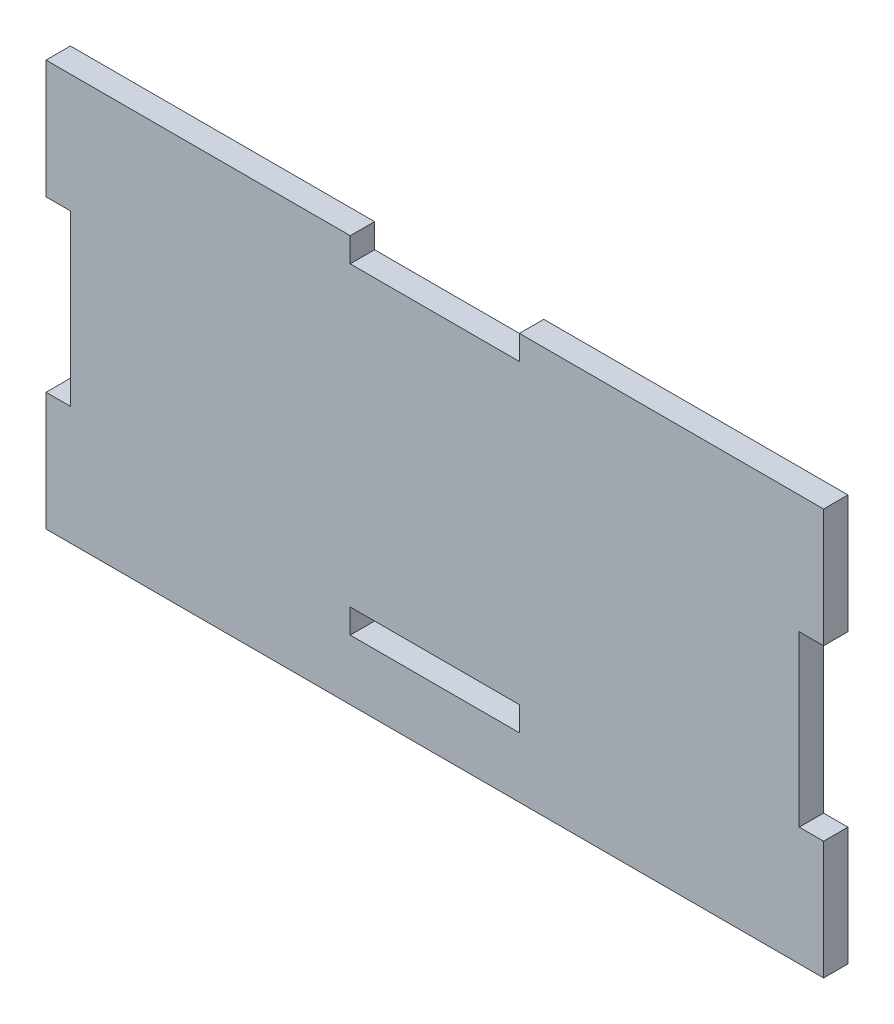
ISO-10303-21;
HEADER;
FILE_DESCRIPTION(('STEP AP214'),'2;1');
FILE_NAME('part.step','',(''),(''),'','','');
FILE_SCHEMA(('AUTOMOTIVE_DESIGN { 1 0 10303 214 1 1 1 1 }'));
ENDSEC;
DATA;
#1=APPLICATION_CONTEXT('core data for automotive mechanical design processes');
#2=APPLICATION_PROTOCOL_DEFINITION('international standard','automotive_design',2000,#1);
#3=PRODUCT_CONTEXT('',#1,'mechanical');
#4=PRODUCT('Part','Part','',(#3));
#5=PRODUCT_RELATED_PRODUCT_CATEGORY('part','',(#4));
#6=PRODUCT_DEFINITION_FORMATION('','',#4);
#7=PRODUCT_DEFINITION_CONTEXT('part definition',#1,'design');
#8=PRODUCT_DEFINITION('design','',#6,#7);
#9=PRODUCT_DEFINITION_SHAPE('','',#8);
#10=(LENGTH_UNIT() NAMED_UNIT(*) SI_UNIT(.MILLI.,.METRE.));
#11=(NAMED_UNIT(*) PLANE_ANGLE_UNIT() SI_UNIT($,.RADIAN.));
#12=(NAMED_UNIT(*) SI_UNIT($,.STERADIAN.) SOLID_ANGLE_UNIT());
#13=UNCERTAINTY_MEASURE_WITH_UNIT(LENGTH_MEASURE(1.E-05),#10,'distance_accuracy_value','');
#14=(GEOMETRIC_REPRESENTATION_CONTEXT(3) GLOBAL_UNCERTAINTY_ASSIGNED_CONTEXT((#13)) GLOBAL_UNIT_ASSIGNED_CONTEXT((#10,
#11,#12)) REPRESENTATION_CONTEXT('',''));
#15=CARTESIAN_POINT('',(0.,0.,0.));
#16=DIRECTION('',(0.,0.,1.));
#17=DIRECTION('',(1.,0.,0.));
#18=AXIS2_PLACEMENT_3D('',#15,#16,#17);
#19=CARTESIAN_POINT('',(-43.7642,-22.86,2.7432));
#20=DIRECTION('',(1.,0.,0.));
#21=DIRECTION('',(0.,0.,-1.));
#22=AXIS2_PLACEMENT_3D('',#19,#20,#21);
#23=PLANE('',#22);
#24=DIRECTION('',(0.,-1.,0.));
#25=VECTOR('',#24,1.);
#26=CARTESIAN_POINT('',(-43.7642,-22.86,0.));
#27=LINE('',#26,#25);
#28=CARTESIAN_POINT('',(-43.7642,22.86,0.));
#29=VERTEX_POINT('',#28);
#30=CARTESIAN_POINT('',(-43.7642,9.525,0.));
#31=VERTEX_POINT('',#30);
#32=EDGE_CURVE('E301',#29,#31,#27,.T.);
#33=ORIENTED_EDGE('',*,*,#32,.T.);
#34=DIRECTION('',(0.,0.,1.));
#35=VECTOR('',#34,1.);
#36=CARTESIAN_POINT('',(-43.7642,9.525,0.));
#37=LINE('',#36,#35);
#38=CARTESIAN_POINT('',(-43.7642,9.525,2.7432));
#39=VERTEX_POINT('',#38);
#40=EDGE_CURVE('E201',#31,#39,#37,.T.);
#41=ORIENTED_EDGE('',*,*,#40,.T.);
#42=DIRECTION('',(0.,-1.,0.));
#43=VECTOR('',#42,1.);
#44=CARTESIAN_POINT('',(-43.7642,-22.86,2.7432));
#45=LINE('',#44,#43);
#46=CARTESIAN_POINT('',(-43.7642,22.86,2.7432));
#47=VERTEX_POINT('',#46);
#48=EDGE_CURVE('E286',#47,#39,#45,.T.);
#49=ORIENTED_EDGE('',*,*,#48,.F.);
#50=DIRECTION('',(0.,0.,-1.));
#51=VECTOR('',#50,1.);
#52=CARTESIAN_POINT('',(-43.7642,22.86,2.7432));
#53=LINE('',#52,#51);
#54=EDGE_CURVE('E300',#47,#29,#53,.T.);
#55=ORIENTED_EDGE('',*,*,#54,.T.);
#56=EDGE_LOOP('',(#33,#41,#49,#55));
#57=FACE_BOUND('',#56,.T.);
#58=ADVANCED_FACE('F33',(#57),#23,.F.);
#59=CARTESIAN_POINT('',(43.7642,-22.86,2.7432));
#60=DIRECTION('',(-1.,0.,0.));
#61=DIRECTION('',(0.,0.,1.));
#62=AXIS2_PLACEMENT_3D('',#59,#60,#61);
#63=PLANE('',#62);
#64=DIRECTION('',(0.,1.,0.));
#65=VECTOR('',#64,1.);
#66=CARTESIAN_POINT('',(43.7642,-22.86,0.));
#67=LINE('',#66,#65);
#68=CARTESIAN_POINT('',(43.7642,-22.86,0.));
#69=VERTEX_POINT('',#68);
#70=CARTESIAN_POINT('',(43.7642,-9.52500000000001,0.));
#71=VERTEX_POINT('',#70);
#72=EDGE_CURVE('E307',#69,#71,#67,.T.);
#73=ORIENTED_EDGE('',*,*,#72,.T.);
#74=DIRECTION('',(0.,0.,1.));
#75=VECTOR('',#74,1.);
#76=CARTESIAN_POINT('',(43.7642,-9.52500000000001,0.));
#77=LINE('',#76,#75);
#78=CARTESIAN_POINT('',(43.7642,-9.52500000000001,2.7432));
#79=VERTEX_POINT('',#78);
#80=EDGE_CURVE('E199',#71,#79,#77,.T.);
#81=ORIENTED_EDGE('',*,*,#80,.T.);
#82=DIRECTION('',(0.,1.,0.));
#83=VECTOR('',#82,1.);
#84=CARTESIAN_POINT('',(43.7642,-22.86,2.7432));
#85=LINE('',#84,#83);
#86=CARTESIAN_POINT('',(43.7642,-22.86,2.7432));
#87=VERTEX_POINT('',#86);
#88=EDGE_CURVE('E293',#87,#79,#85,.T.);
#89=ORIENTED_EDGE('',*,*,#88,.F.);
#90=DIRECTION('',(0.,0.,-1.));
#91=VECTOR('',#90,1.);
#92=CARTESIAN_POINT('',(43.7642,-22.86,2.7432));
#93=LINE('',#92,#91);
#94=EDGE_CURVE('E41',#87,#69,#93,.T.);
#95=ORIENTED_EDGE('',*,*,#94,.T.);
#96=EDGE_LOOP('',(#73,#81,#89,#95));
#97=FACE_BOUND('',#96,.T.);
#98=ADVANCED_FACE('F323',(#97),#63,.F.);
#99=CARTESIAN_POINT('',(43.7642,22.86,2.7432));
#100=DIRECTION('',(0.,-1.,0.));
#101=DIRECTION('',(1.,0.,0.));
#102=AXIS2_PLACEMENT_3D('',#99,#100,#101);
#103=PLANE('',#102);
#104=DIRECTION('',(-1.,0.,0.));
#105=VECTOR('',#104,1.);
#106=CARTESIAN_POINT('',(43.7642,22.86,2.7432));
#107=LINE('',#106,#105);
#108=CARTESIAN_POINT('',(-9.525,22.86,2.7432));
#109=VERTEX_POINT('',#108);
#110=EDGE_CURVE('E296',#109,#47,#107,.T.);
#111=ORIENTED_EDGE('',*,*,#110,.F.);
#112=DIRECTION('',(0.,0.,1.));
#113=VECTOR('',#112,1.);
#114=CARTESIAN_POINT('',(-9.525,22.86,0.));
#115=LINE('',#114,#113);
#116=CARTESIAN_POINT('',(-9.525,22.86,0.));
#117=VERTEX_POINT('',#116);
#118=EDGE_CURVE('E220',#117,#109,#115,.T.);
#119=ORIENTED_EDGE('',*,*,#118,.F.);
#120=DIRECTION('',(-1.,0.,0.));
#121=VECTOR('',#120,1.);
#122=CARTESIAN_POINT('',(43.7642,22.86,0.));
#123=LINE('',#122,#121);
#124=EDGE_CURVE('E310',#117,#29,#123,.T.);
#125=ORIENTED_EDGE('',*,*,#124,.T.);
#126=ORIENTED_EDGE('',*,*,#54,.F.);
#127=EDGE_LOOP('',(#111,#119,#125,#126));
#128=FACE_BOUND('',#127,.T.);
#129=ADVANCED_FACE('F350',(#128),#103,.F.);
#130=CARTESIAN_POINT('',(0.,0.,2.7432));
#131=DIRECTION('',(0.,0.,1.));
#132=DIRECTION('',(1.,0.,0.));
#133=AXIS2_PLACEMENT_3D('',#130,#131,#132);
#134=PLANE('',#133);
#135=DIRECTION('',(-1.,0.,0.));
#136=VECTOR('',#135,1.);
#137=CARTESIAN_POINT('',(-41.021,9.525,2.7432));
#138=LINE('',#137,#136);
#139=CARTESIAN_POINT('',(-41.021,9.525,2.7432));
#140=VERTEX_POINT('',#139);
#141=EDGE_CURVE('E192',#140,#39,#138,.T.);
#142=ORIENTED_EDGE('',*,*,#141,.F.);
#143=DIRECTION('',(0.,1.,0.));
#144=VECTOR('',#143,1.);
#145=CARTESIAN_POINT('',(-41.021,-9.52500000000001,2.7432));
#146=LINE('',#145,#144);
#147=CARTESIAN_POINT('',(-41.021,-9.52500000000001,2.7432));
#148=VERTEX_POINT('',#147);
#149=EDGE_CURVE('E194',#148,#140,#146,.T.);
#150=ORIENTED_EDGE('',*,*,#149,.F.);
#151=DIRECTION('',(1.,0.,0.));
#152=VECTOR('',#151,1.);
#153=CARTESIAN_POINT('',(-41.021,-9.52500000000001,2.7432));
#154=LINE('',#153,#152);
#155=CARTESIAN_POINT('',(-43.7642,-9.52500000000001,2.7432));
#156=VERTEX_POINT('',#155);
#157=EDGE_CURVE('E172',#156,#148,#154,.T.);
#158=ORIENTED_EDGE('',*,*,#157,.F.);
#159=CARTESIAN_POINT('',(-43.7642,-22.86,2.7432));
#160=VERTEX_POINT('',#159);
#161=EDGE_CURVE('E290',#156,#160,#45,.T.);
#162=ORIENTED_EDGE('',*,*,#161,.T.);
#163=DIRECTION('',(1.,0.,0.));
#164=VECTOR('',#163,1.);
#165=CARTESIAN_POINT('',(43.7642,-22.86,2.7432));
#166=LINE('',#165,#164);
#167=EDGE_CURVE('E289',#160,#87,#166,.T.);
#168=ORIENTED_EDGE('',*,*,#167,.T.);
#169=ORIENTED_EDGE('',*,*,#88,.T.);
#170=DIRECTION('',(1.,0.,0.));
#171=VECTOR('',#170,1.);
#172=CARTESIAN_POINT('',(41.021,-9.52500000000001,2.7432));
#173=LINE('',#172,#171);
#174=CARTESIAN_POINT('',(41.021,-9.52500000000001,2.7432));
#175=VERTEX_POINT('',#174);
#176=EDGE_CURVE('E209',#175,#79,#173,.T.);
#177=ORIENTED_EDGE('',*,*,#176,.F.);
#178=DIRECTION('',(0.,-1.,0.));
#179=VECTOR('',#178,1.);
#180=CARTESIAN_POINT('',(41.021,9.525,2.7432));
#181=LINE('',#180,#179);
#182=CARTESIAN_POINT('',(41.021,9.525,2.7432));
#183=VERTEX_POINT('',#182);
#184=EDGE_CURVE('E219',#183,#175,#181,.T.);
#185=ORIENTED_EDGE('',*,*,#184,.F.);
#186=DIRECTION('',(-1.,0.,0.));
#187=VECTOR('',#186,1.);
#188=CARTESIAN_POINT('',(41.021,9.525,2.7432));
#189=LINE('',#188,#187);
#190=CARTESIAN_POINT('',(43.7642,9.525,2.7432));
#191=VERTEX_POINT('',#190);
#192=EDGE_CURVE('E216',#191,#183,#189,.T.);
#193=ORIENTED_EDGE('',*,*,#192,.F.);
#194=CARTESIAN_POINT('',(43.7642,22.86,2.7432));
#195=VERTEX_POINT('',#194);
#196=EDGE_CURVE('E292',#191,#195,#85,.T.);
#197=ORIENTED_EDGE('',*,*,#196,.T.);
#198=CARTESIAN_POINT('',(9.525,22.86,2.7432));
#199=VERTEX_POINT('',#198);
#200=EDGE_CURVE('E297',#195,#199,#107,.T.);
#201=ORIENTED_EDGE('',*,*,#200,.T.);
#202=DIRECTION('',(0.,1.,0.));
#203=VECTOR('',#202,1.);
#204=CARTESIAN_POINT('',(9.525,20.1168,2.7432));
#205=LINE('',#204,#203);
#206=CARTESIAN_POINT('',(9.525,20.1168,2.7432));
#207=VERTEX_POINT('',#206);
#208=EDGE_CURVE('E235',#207,#199,#205,.T.);
#209=ORIENTED_EDGE('',*,*,#208,.F.);
#210=DIRECTION('',(1.,0.,0.));
#211=VECTOR('',#210,1.);
#212=CARTESIAN_POINT('',(9.525,20.1168,2.7432));
#213=LINE('',#212,#211);
#214=CARTESIAN_POINT('',(-9.525,20.1168,2.7432));
#215=VERTEX_POINT('',#214);
#216=EDGE_CURVE('E245',#215,#207,#213,.T.);
#217=ORIENTED_EDGE('',*,*,#216,.F.);
#218=DIRECTION('',(0.,-1.,0.));
#219=VECTOR('',#218,1.);
#220=CARTESIAN_POINT('',(-9.525,20.1168,2.7432));
#221=LINE('',#220,#219);
#222=EDGE_CURVE('E242',#109,#215,#221,.T.);
#223=ORIENTED_EDGE('',*,*,#222,.F.);
#224=ORIENTED_EDGE('',*,*,#110,.T.);
#225=ORIENTED_EDGE('',*,*,#48,.T.);
#226=EDGE_LOOP('',(#142,#150,#158,#162,#168,#169,#177,#185,#193,#197,#201,#209,#217,#223,#224,#225));
#227=FACE_BOUND('',#226,.T.);
#228=DIRECTION('',(-1.,0.,0.));
#229=VECTOR('',#228,1.);
#230=CARTESIAN_POINT('',(-9.52500000000002,-13.335,2.7432));
#231=LINE('',#230,#229);
#232=CARTESIAN_POINT('',(9.52499999999998,-13.335,2.7432));
#233=VERTEX_POINT('',#232);
#234=CARTESIAN_POINT('',(-9.52500000000002,-13.335,2.7432));
#235=VERTEX_POINT('',#234);
#236=EDGE_CURVE('E258',#233,#235,#231,.T.);
#237=ORIENTED_EDGE('',*,*,#236,.F.);
#238=DIRECTION('',(0.,1.,0.));
#239=VECTOR('',#238,1.);
#240=CARTESIAN_POINT('',(9.52499999999998,-16.0782,2.7432));
#241=LINE('',#240,#239);
#242=CARTESIAN_POINT('',(9.52499999999998,-16.0782,2.7432));
#243=VERTEX_POINT('',#242);
#244=EDGE_CURVE('E256',#243,#233,#241,.T.);
#245=ORIENTED_EDGE('',*,*,#244,.F.);
#246=DIRECTION('',(1.,0.,0.));
#247=VECTOR('',#246,1.);
#248=CARTESIAN_POINT('',(-9.52500000000002,-16.0782,2.7432));
#249=LINE('',#248,#247);
#250=CARTESIAN_POINT('',(-9.52500000000002,-16.0782,2.7432));
#251=VERTEX_POINT('',#250);
#252=EDGE_CURVE('E264',#251,#243,#249,.T.);
#253=ORIENTED_EDGE('',*,*,#252,.F.);
#254=DIRECTION('',(0.,-1.,0.));
#255=VECTOR('',#254,1.);
#256=CARTESIAN_POINT('',(-9.52500000000002,-16.0782,2.7432));
#257=LINE('',#256,#255);
#258=EDGE_CURVE('E261',#235,#251,#257,.T.);
#259=ORIENTED_EDGE('',*,*,#258,.F.);
#260=EDGE_LOOP('',(#237,#245,#253,#259));
#261=FACE_BOUND('',#260,.T.);
#262=ADVANCED_FACE('F333',(#227,#261),#134,.T.);
#263=CARTESIAN_POINT('',(0.,0.,0.));
#264=DIRECTION('',(0.,0.,1.));
#265=DIRECTION('',(1.,0.,0.));
#266=AXIS2_PLACEMENT_3D('',#263,#264,#265);
#267=PLANE('',#266);
#268=DIRECTION('',(0.,1.,0.));
#269=VECTOR('',#268,1.);
#270=CARTESIAN_POINT('',(-41.021,-9.52500000000001,0.));
#271=LINE('',#270,#269);
#272=CARTESIAN_POINT('',(-41.021,-9.52500000000001,0.));
#273=VERTEX_POINT('',#272);
#274=CARTESIAN_POINT('',(-41.021,9.525,0.));
#275=VERTEX_POINT('',#274);
#276=EDGE_CURVE('E180',#273,#275,#271,.T.);
#277=ORIENTED_EDGE('',*,*,#276,.T.);
#278=DIRECTION('',(-1.,0.,0.));
#279=VECTOR('',#278,1.);
#280=CARTESIAN_POINT('',(-41.021,9.525,0.));
#281=LINE('',#280,#279);
#282=EDGE_CURVE('E185',#275,#31,#281,.T.);
#283=ORIENTED_EDGE('',*,*,#282,.T.);
#284=ORIENTED_EDGE('',*,*,#32,.F.);
#285=ORIENTED_EDGE('',*,*,#124,.F.);
#286=DIRECTION('',(0.,-1.,0.));
#287=VECTOR('',#286,1.);
#288=CARTESIAN_POINT('',(-9.525,20.1168,0.));
#289=LINE('',#288,#287);
#290=CARTESIAN_POINT('',(-9.525,20.1168,0.));
#291=VERTEX_POINT('',#290);
#292=EDGE_CURVE('E231',#117,#291,#289,.T.);
#293=ORIENTED_EDGE('',*,*,#292,.T.);
#294=DIRECTION('',(1.,0.,0.));
#295=VECTOR('',#294,1.);
#296=CARTESIAN_POINT('',(9.525,20.1168,0.));
#297=LINE('',#296,#295);
#298=CARTESIAN_POINT('',(9.525,20.1168,0.));
#299=VERTEX_POINT('',#298);
#300=EDGE_CURVE('E234',#291,#299,#297,.T.);
#301=ORIENTED_EDGE('',*,*,#300,.T.);
#302=DIRECTION('',(0.,1.,0.));
#303=VECTOR('',#302,1.);
#304=CARTESIAN_POINT('',(9.525,20.1168,0.));
#305=LINE('',#304,#303);
#306=CARTESIAN_POINT('',(9.525,22.86,0.));
#307=VERTEX_POINT('',#306);
#308=EDGE_CURVE('E238',#299,#307,#305,.T.);
#309=ORIENTED_EDGE('',*,*,#308,.T.);
#310=CARTESIAN_POINT('',(43.7642,22.86,0.));
#311=VERTEX_POINT('',#310);
#312=EDGE_CURVE('E311',#311,#307,#123,.T.);
#313=ORIENTED_EDGE('',*,*,#312,.F.);
#314=CARTESIAN_POINT('',(43.7642,9.525,0.));
#315=VERTEX_POINT('',#314);
#316=EDGE_CURVE('E306',#315,#311,#67,.T.);
#317=ORIENTED_EDGE('',*,*,#316,.F.);
#318=DIRECTION('',(-1.,0.,0.));
#319=VECTOR('',#318,1.);
#320=CARTESIAN_POINT('',(41.021,9.525,0.));
#321=LINE('',#320,#319);
#322=CARTESIAN_POINT('',(41.021,9.525,0.));
#323=VERTEX_POINT('',#322);
#324=EDGE_CURVE('E56',#315,#323,#321,.T.);
#325=ORIENTED_EDGE('',*,*,#324,.T.);
#326=DIRECTION('',(0.,-1.,0.));
#327=VECTOR('',#326,1.);
#328=CARTESIAN_POINT('',(41.021,9.525,0.));
#329=LINE('',#328,#327);
#330=CARTESIAN_POINT('',(41.021,-9.52500000000001,0.));
#331=VERTEX_POINT('',#330);
#332=EDGE_CURVE('E208',#323,#331,#329,.T.);
#333=ORIENTED_EDGE('',*,*,#332,.T.);
#334=DIRECTION('',(1.,0.,0.));
#335=VECTOR('',#334,1.);
#336=CARTESIAN_POINT('',(41.021,-9.52500000000001,0.));
#337=LINE('',#336,#335);
#338=EDGE_CURVE('E212',#331,#71,#337,.T.);
#339=ORIENTED_EDGE('',*,*,#338,.T.);
#340=ORIENTED_EDGE('',*,*,#72,.F.);
#341=DIRECTION('',(1.,0.,0.));
#342=VECTOR('',#341,1.);
#343=CARTESIAN_POINT('',(43.7642,-22.86,0.));
#344=LINE('',#343,#342);
#345=CARTESIAN_POINT('',(-43.7642,-22.86,0.));
#346=VERTEX_POINT('',#345);
#347=EDGE_CURVE('E304',#346,#69,#344,.T.);
#348=ORIENTED_EDGE('',*,*,#347,.F.);
#349=CARTESIAN_POINT('',(-43.7642,-9.52500000000001,0.));
#350=VERTEX_POINT('',#349);
#351=EDGE_CURVE('E191',#350,#346,#27,.T.);
#352=ORIENTED_EDGE('',*,*,#351,.F.);
#353=DIRECTION('',(1.,0.,0.));
#354=VECTOR('',#353,1.);
#355=CARTESIAN_POINT('',(-41.021,-9.52500000000001,0.));
#356=LINE('',#355,#354);
#357=EDGE_CURVE('E48',#350,#273,#356,.T.);
#358=ORIENTED_EDGE('',*,*,#357,.T.);
#359=EDGE_LOOP('',(#277,#283,#284,#285,#293,#301,#309,#313,#317,#325,#333,#339,#340,#348,#352,#358));
#360=FACE_BOUND('',#359,.T.);
#361=DIRECTION('',(0.,1.,0.));
#362=VECTOR('',#361,1.);
#363=CARTESIAN_POINT('',(9.52499999999998,-16.0782,0.));
#364=LINE('',#363,#362);
#365=CARTESIAN_POINT('',(9.52499999999998,-16.0782,0.));
#366=VERTEX_POINT('',#365);
#367=CARTESIAN_POINT('',(9.52499999999998,-13.335,0.));
#368=VERTEX_POINT('',#367);
#369=EDGE_CURVE('E204',#366,#368,#364,.T.);
#370=ORIENTED_EDGE('',*,*,#369,.T.);
#371=DIRECTION('',(-1.,0.,0.));
#372=VECTOR('',#371,1.);
#373=CARTESIAN_POINT('',(-9.52500000000002,-13.335,0.));
#374=LINE('',#373,#372);
#375=CARTESIAN_POINT('',(-9.52500000000002,-13.335,0.));
#376=VERTEX_POINT('',#375);
#377=EDGE_CURVE('E269',#368,#376,#374,.T.);
#378=ORIENTED_EDGE('',*,*,#377,.T.);
#379=DIRECTION('',(0.,-1.,0.));
#380=VECTOR('',#379,1.);
#381=CARTESIAN_POINT('',(-9.52500000000002,-16.0782,0.));
#382=LINE('',#381,#380);
#383=CARTESIAN_POINT('',(-9.52500000000002,-16.0782,0.));
#384=VERTEX_POINT('',#383);
#385=EDGE_CURVE('E272',#376,#384,#382,.T.);
#386=ORIENTED_EDGE('',*,*,#385,.T.);
#387=DIRECTION('',(1.,0.,0.));
#388=VECTOR('',#387,1.);
#389=CARTESIAN_POINT('',(-9.52500000000002,-16.0782,0.));
#390=LINE('',#389,#388);
#391=EDGE_CURVE('E259',#384,#366,#390,.T.);
#392=ORIENTED_EDGE('',*,*,#391,.T.);
#393=EDGE_LOOP('',(#370,#378,#386,#392));
#394=FACE_BOUND('',#393,.T.);
#395=ADVANCED_FACE('F188',(#360,#394),#267,.F.);
#396=ORIENTED_EDGE('',*,*,#161,.F.);
#397=DIRECTION('',(0.,0.,1.));
#398=VECTOR('',#397,1.);
#399=CARTESIAN_POINT('',(-43.7642,-9.52500000000001,0.));
#400=LINE('',#399,#398);
#401=EDGE_CURVE('E177',#350,#156,#400,.T.);
#402=ORIENTED_EDGE('',*,*,#401,.F.);
#403=ORIENTED_EDGE('',*,*,#351,.T.);
#404=DIRECTION('',(0.,0.,-1.));
#405=VECTOR('',#404,1.);
#406=CARTESIAN_POINT('',(-43.7642,-22.86,2.7432));
#407=LINE('',#406,#405);
#408=EDGE_CURVE('E11',#160,#346,#407,.T.);
#409=ORIENTED_EDGE('',*,*,#408,.F.);
#410=EDGE_LOOP('',(#396,#402,#403,#409));
#411=FACE_BOUND('',#410,.T.);
#412=ADVANCED_FACE('F35',(#411),#23,.F.);
#413=CARTESIAN_POINT('',(43.7642,-22.86,2.7432));
#414=DIRECTION('',(0.,1.,0.));
#415=DIRECTION('',(-1.,0.,0.));
#416=AXIS2_PLACEMENT_3D('',#413,#414,#415);
#417=PLANE('',#416);
#418=ORIENTED_EDGE('',*,*,#347,.T.);
#419=ORIENTED_EDGE('',*,*,#94,.F.);
#420=ORIENTED_EDGE('',*,*,#167,.F.);
#421=ORIENTED_EDGE('',*,*,#408,.T.);
#422=EDGE_LOOP('',(#418,#419,#420,#421));
#423=FACE_BOUND('',#422,.T.);
#424=ADVANCED_FACE('F338',(#423),#417,.F.);
#425=ORIENTED_EDGE('',*,*,#196,.F.);
#426=DIRECTION('',(0.,0.,1.));
#427=VECTOR('',#426,1.);
#428=CARTESIAN_POINT('',(43.7642,9.525,0.));
#429=LINE('',#428,#427);
#430=EDGE_CURVE('E215',#315,#191,#429,.T.);
#431=ORIENTED_EDGE('',*,*,#430,.F.);
#432=ORIENTED_EDGE('',*,*,#316,.T.);
#433=DIRECTION('',(0.,0.,-1.));
#434=VECTOR('',#433,1.);
#435=CARTESIAN_POINT('',(43.7642,22.86,2.7432));
#436=LINE('',#435,#434);
#437=EDGE_CURVE('E316',#195,#311,#436,.T.);
#438=ORIENTED_EDGE('',*,*,#437,.F.);
#439=EDGE_LOOP('',(#425,#431,#432,#438));
#440=FACE_BOUND('',#439,.T.);
#441=ADVANCED_FACE('F369',(#440),#63,.F.);
#442=ORIENTED_EDGE('',*,*,#312,.T.);
#443=DIRECTION('',(0.,0.,1.));
#444=VECTOR('',#443,1.);
#445=CARTESIAN_POINT('',(9.525,22.86,0.));
#446=LINE('',#445,#444);
#447=EDGE_CURVE('E250',#307,#199,#446,.T.);
#448=ORIENTED_EDGE('',*,*,#447,.T.);
#449=ORIENTED_EDGE('',*,*,#200,.F.);
#450=ORIENTED_EDGE('',*,*,#437,.T.);
#451=EDGE_LOOP('',(#442,#448,#449,#450));
#452=FACE_BOUND('',#451,.T.);
#453=ADVANCED_FACE('F364',(#452),#103,.F.);
#454=CARTESIAN_POINT('',(9.52499999999998,-16.0782,2.7432));
#455=DIRECTION('',(-1.,0.,0.));
#456=DIRECTION('',(0.,0.,1.));
#457=AXIS2_PLACEMENT_3D('',#454,#455,#456);
#458=PLANE('',#457);
#459=ORIENTED_EDGE('',*,*,#369,.F.);
#460=DIRECTION('',(0.,0.,-1.));
#461=VECTOR('',#460,1.);
#462=CARTESIAN_POINT('',(9.52499999999998,-16.0782,2.7432));
#463=LINE('',#462,#461);
#464=EDGE_CURVE('E266',#243,#366,#463,.T.);
#465=ORIENTED_EDGE('',*,*,#464,.F.);
#466=ORIENTED_EDGE('',*,*,#244,.T.);
#467=DIRECTION('',(0.,0.,-1.));
#468=VECTOR('',#467,1.);
#469=CARTESIAN_POINT('',(9.52499999999998,-13.335,2.7432));
#470=LINE('',#469,#468);
#471=EDGE_CURVE('E283',#233,#368,#470,.T.);
#472=ORIENTED_EDGE('',*,*,#471,.T.);
#473=EDGE_LOOP('',(#459,#465,#466,#472));
#474=FACE_BOUND('',#473,.T.);
#475=ADVANCED_FACE('F400',(#474),#458,.T.);
#476=CARTESIAN_POINT('',(-9.52500000000002,-13.335,2.7432));
#477=DIRECTION('',(0.,-1.,0.));
#478=DIRECTION('',(0.,0.,-1.));
#479=AXIS2_PLACEMENT_3D('',#476,#477,#478);
#480=PLANE('',#479);
#481=ORIENTED_EDGE('',*,*,#377,.F.);
#482=ORIENTED_EDGE('',*,*,#471,.F.);
#483=ORIENTED_EDGE('',*,*,#236,.T.);
#484=DIRECTION('',(0.,0.,-1.));
#485=VECTOR('',#484,1.);
#486=CARTESIAN_POINT('',(-9.52500000000002,-13.335,2.7432));
#487=LINE('',#486,#485);
#488=EDGE_CURVE('E281',#235,#376,#487,.T.);
#489=ORIENTED_EDGE('',*,*,#488,.T.);
#490=EDGE_LOOP('',(#481,#482,#483,#489));
#491=FACE_BOUND('',#490,.T.);
#492=ADVANCED_FACE('F417',(#491),#480,.T.);
#493=CARTESIAN_POINT('',(-9.52500000000002,-16.0782,2.7432));
#494=DIRECTION('',(1.,0.,0.));
#495=DIRECTION('',(0.,0.,-1.));
#496=AXIS2_PLACEMENT_3D('',#493,#494,#495);
#497=PLANE('',#496);
#498=ORIENTED_EDGE('',*,*,#385,.F.);
#499=ORIENTED_EDGE('',*,*,#488,.F.);
#500=ORIENTED_EDGE('',*,*,#258,.T.);
#501=DIRECTION('',(0.,0.,-1.));
#502=VECTOR('',#501,1.);
#503=CARTESIAN_POINT('',(-9.52500000000002,-16.0782,2.7432));
#504=LINE('',#503,#502);
#505=EDGE_CURVE('E279',#251,#384,#504,.T.);
#506=ORIENTED_EDGE('',*,*,#505,.T.);
#507=EDGE_LOOP('',(#498,#499,#500,#506));
#508=FACE_BOUND('',#507,.T.);
#509=ADVANCED_FACE('F424',(#508),#497,.T.);
#510=CARTESIAN_POINT('',(-9.52500000000002,-16.0782,2.7432));
#511=DIRECTION('',(0.,1.,0.));
#512=DIRECTION('',(0.,0.,1.));
#513=AXIS2_PLACEMENT_3D('',#510,#511,#512);
#514=PLANE('',#513);
#515=ORIENTED_EDGE('',*,*,#391,.F.);
#516=ORIENTED_EDGE('',*,*,#505,.F.);
#517=ORIENTED_EDGE('',*,*,#252,.T.);
#518=ORIENTED_EDGE('',*,*,#464,.T.);
#519=EDGE_LOOP('',(#515,#516,#517,#518));
#520=FACE_BOUND('',#519,.T.);
#521=ADVANCED_FACE('F432',(#520),#514,.T.);
#522=CARTESIAN_POINT('',(-9.525,20.1168,0.));
#523=DIRECTION('',(-1.,0.,0.));
#524=DIRECTION('',(0.,0.,1.));
#525=AXIS2_PLACEMENT_3D('',#522,#523,#524);
#526=PLANE('',#525);
#527=ORIENTED_EDGE('',*,*,#222,.T.);
#528=DIRECTION('',(0.,0.,1.));
#529=VECTOR('',#528,1.);
#530=CARTESIAN_POINT('',(-9.525,20.1168,0.));
#531=LINE('',#530,#529);
#532=EDGE_CURVE('E241',#291,#215,#531,.T.);
#533=ORIENTED_EDGE('',*,*,#532,.F.);
#534=ORIENTED_EDGE('',*,*,#292,.F.);
#535=ORIENTED_EDGE('',*,*,#118,.T.);
#536=EDGE_LOOP('',(#527,#533,#534,#535));
#537=FACE_BOUND('',#536,.T.);
#538=ADVANCED_FACE('F353',(#537),#526,.F.);
#539=CARTESIAN_POINT('',(9.525,20.1168,0.));
#540=DIRECTION('',(1.,0.,0.));
#541=DIRECTION('',(0.,0.,-1.));
#542=AXIS2_PLACEMENT_3D('',#539,#540,#541);
#543=PLANE('',#542);
#544=ORIENTED_EDGE('',*,*,#208,.T.);
#545=ORIENTED_EDGE('',*,*,#447,.F.);
#546=ORIENTED_EDGE('',*,*,#308,.F.);
#547=DIRECTION('',(0.,0.,1.));
#548=VECTOR('',#547,1.);
#549=CARTESIAN_POINT('',(9.525,20.1168,0.));
#550=LINE('',#549,#548);
#551=EDGE_CURVE('E253',#299,#207,#550,.T.);
#552=ORIENTED_EDGE('',*,*,#551,.T.);
#553=EDGE_LOOP('',(#544,#545,#546,#552));
#554=FACE_BOUND('',#553,.T.);
#555=ADVANCED_FACE('F446',(#554),#543,.F.);
#556=CARTESIAN_POINT('',(9.525,20.1168,0.));
#557=DIRECTION('',(0.,-1.,0.));
#558=DIRECTION('',(1.,0.,0.));
#559=AXIS2_PLACEMENT_3D('',#556,#557,#558);
#560=PLANE('',#559);
#561=ORIENTED_EDGE('',*,*,#216,.T.);
#562=ORIENTED_EDGE('',*,*,#551,.F.);
#563=ORIENTED_EDGE('',*,*,#300,.F.);
#564=ORIENTED_EDGE('',*,*,#532,.T.);
#565=EDGE_LOOP('',(#561,#562,#563,#564));
#566=FACE_BOUND('',#565,.T.);
#567=ADVANCED_FACE('F357',(#566),#560,.F.);
#568=CARTESIAN_POINT('',(41.021,-9.52500000000001,0.));
#569=DIRECTION('',(0.,-1.,0.));
#570=DIRECTION('',(0.,0.,-1.));
#571=AXIS2_PLACEMENT_3D('',#568,#569,#570);
#572=PLANE('',#571);
#573=ORIENTED_EDGE('',*,*,#176,.T.);
#574=ORIENTED_EDGE('',*,*,#80,.F.);
#575=ORIENTED_EDGE('',*,*,#338,.F.);
#576=DIRECTION('',(0.,0.,1.));
#577=VECTOR('',#576,1.);
#578=CARTESIAN_POINT('',(41.021,-9.52500000000001,0.));
#579=LINE('',#578,#577);
#580=EDGE_CURVE('E226',#331,#175,#579,.T.);
#581=ORIENTED_EDGE('',*,*,#580,.T.);
#582=EDGE_LOOP('',(#573,#574,#575,#581));
#583=FACE_BOUND('',#582,.T.);
#584=ADVANCED_FACE('F329',(#583),#572,.F.);
#585=CARTESIAN_POINT('',(41.021,9.525,0.));
#586=DIRECTION('',(-1.,0.,0.));
#587=DIRECTION('',(0.,-1.,0.));
#588=AXIS2_PLACEMENT_3D('',#585,#586,#587);
#589=PLANE('',#588);
#590=ORIENTED_EDGE('',*,*,#184,.T.);
#591=ORIENTED_EDGE('',*,*,#580,.F.);
#592=ORIENTED_EDGE('',*,*,#332,.F.);
#593=DIRECTION('',(0.,0.,1.));
#594=VECTOR('',#593,1.);
#595=CARTESIAN_POINT('',(41.021,9.525,0.));
#596=LINE('',#595,#594);
#597=EDGE_CURVE('E228',#323,#183,#596,.T.);
#598=ORIENTED_EDGE('',*,*,#597,.T.);
#599=EDGE_LOOP('',(#590,#591,#592,#598));
#600=FACE_BOUND('',#599,.T.);
#601=ADVANCED_FACE('F373',(#600),#589,.F.);
#602=CARTESIAN_POINT('',(41.021,9.525,0.));
#603=DIRECTION('',(0.,1.,0.));
#604=DIRECTION('',(-1.,0.,0.));
#605=AXIS2_PLACEMENT_3D('',#602,#603,#604);
#606=PLANE('',#605);
#607=ORIENTED_EDGE('',*,*,#192,.T.);
#608=ORIENTED_EDGE('',*,*,#597,.F.);
#609=ORIENTED_EDGE('',*,*,#324,.F.);
#610=ORIENTED_EDGE('',*,*,#430,.T.);
#611=EDGE_LOOP('',(#607,#608,#609,#610));
#612=FACE_BOUND('',#611,.T.);
#613=ADVANCED_FACE('F371',(#612),#606,.F.);
#614=CARTESIAN_POINT('',(-41.021,9.525,0.));
#615=DIRECTION('',(0.,1.,0.));
#616=DIRECTION('',(0.,0.,1.));
#617=AXIS2_PLACEMENT_3D('',#614,#615,#616);
#618=PLANE('',#617);
#619=ORIENTED_EDGE('',*,*,#141,.T.);
#620=ORIENTED_EDGE('',*,*,#40,.F.);
#621=ORIENTED_EDGE('',*,*,#282,.F.);
#622=DIRECTION('',(0.,0.,1.));
#623=VECTOR('',#622,1.);
#624=CARTESIAN_POINT('',(-41.021,9.525,0.));
#625=LINE('',#624,#623);
#626=EDGE_CURVE('E176',#275,#140,#625,.T.);
#627=ORIENTED_EDGE('',*,*,#626,.T.);
#628=EDGE_LOOP('',(#619,#620,#621,#627));
#629=FACE_BOUND('',#628,.T.);
#630=ADVANCED_FACE('F342',(#629),#618,.F.);
#631=CARTESIAN_POINT('',(-41.021,-9.52500000000001,0.));
#632=DIRECTION('',(1.,0.,0.));
#633=DIRECTION('',(0.,0.,-1.));
#634=AXIS2_PLACEMENT_3D('',#631,#632,#633);
#635=PLANE('',#634);
#636=ORIENTED_EDGE('',*,*,#149,.T.);
#637=ORIENTED_EDGE('',*,*,#626,.F.);
#638=ORIENTED_EDGE('',*,*,#276,.F.);
#639=DIRECTION('',(0.,0.,1.));
#640=VECTOR('',#639,1.);
#641=CARTESIAN_POINT('',(-41.021,-9.52500000000001,0.));
#642=LINE('',#641,#640);
#643=EDGE_CURVE('E168',#273,#148,#642,.T.);
#644=ORIENTED_EDGE('',*,*,#643,.T.);
#645=EDGE_LOOP('',(#636,#637,#638,#644));
#646=FACE_BOUND('',#645,.T.);
#647=ADVANCED_FACE('F181',(#646),#635,.F.);
#648=CARTESIAN_POINT('',(-41.021,-9.52500000000001,0.));
#649=DIRECTION('',(0.,-1.,0.));
#650=DIRECTION('',(1.,0.,0.));
#651=AXIS2_PLACEMENT_3D('',#648,#649,#650);
#652=PLANE('',#651);
#653=ORIENTED_EDGE('',*,*,#157,.T.);
#654=ORIENTED_EDGE('',*,*,#643,.F.);
#655=ORIENTED_EDGE('',*,*,#357,.F.);
#656=ORIENTED_EDGE('',*,*,#401,.T.);
#657=EDGE_LOOP('',(#653,#654,#655,#656));
#658=FACE_BOUND('',#657,.T.);
#659=ADVANCED_FACE('F170',(#658),#652,.F.);
#660=CLOSED_SHELL('',(#58,#98,#129,#262,#395,#412,#424,#441,#453,#475,#492,#509,#521,#538,#555,
#567,#584,#601,#613,#630,#647,#659));
#661=MANIFOLD_SOLID_BREP('B2',#660);
#662=ADVANCED_BREP_SHAPE_REPRESENTATION('',(#18,#661),#14);
#663=SHAPE_DEFINITION_REPRESENTATION(#9,#662);
ENDSEC;
END-ISO-10303-21;
